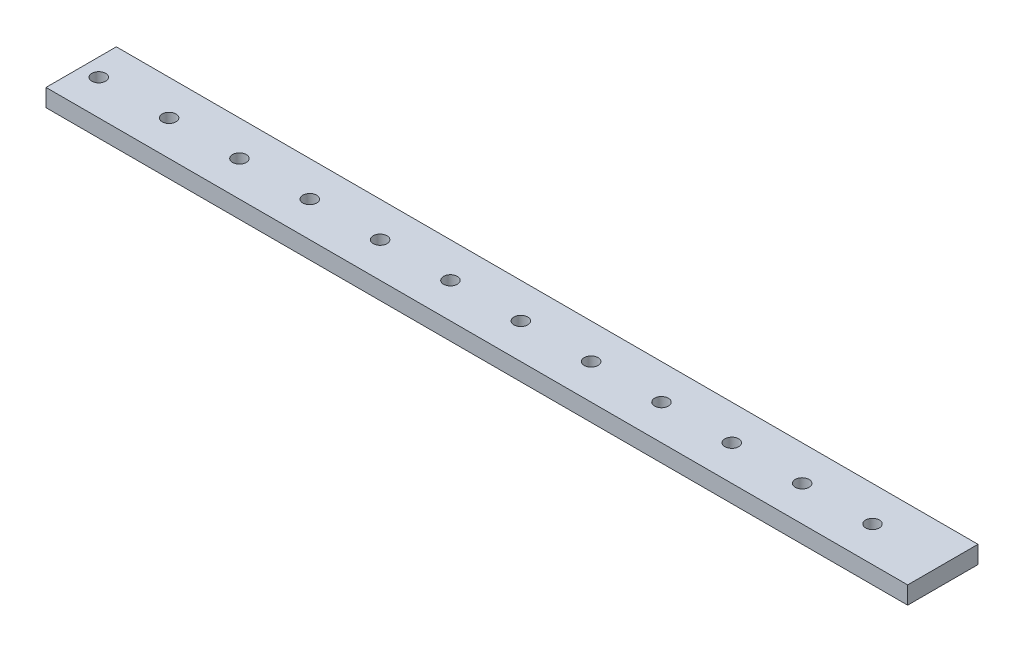
ISO-10303-21;
HEADER;
FILE_DESCRIPTION(('STEP AP214'),'2;1');
FILE_NAME('part.step','',(''),(''),'','','');
FILE_SCHEMA(('AUTOMOTIVE_DESIGN { 1 0 10303 214 1 1 1 1 }'));
ENDSEC;
DATA;
#1=APPLICATION_CONTEXT('core data for automotive mechanical design processes');
#2=APPLICATION_PROTOCOL_DEFINITION('international standard','automotive_design',2000,#1);
#3=PRODUCT_CONTEXT('',#1,'mechanical');
#4=PRODUCT('Part','Part','',(#3));
#5=PRODUCT_RELATED_PRODUCT_CATEGORY('part','',(#4));
#6=PRODUCT_DEFINITION_FORMATION('','',#4);
#7=PRODUCT_DEFINITION_CONTEXT('part definition',#1,'design');
#8=PRODUCT_DEFINITION('design','',#6,#7);
#9=PRODUCT_DEFINITION_SHAPE('','',#8);
#10=(LENGTH_UNIT() NAMED_UNIT(*) SI_UNIT(.MILLI.,.METRE.));
#11=(NAMED_UNIT(*) PLANE_ANGLE_UNIT() SI_UNIT($,.RADIAN.));
#12=(NAMED_UNIT(*) SI_UNIT($,.STERADIAN.) SOLID_ANGLE_UNIT());
#13=UNCERTAINTY_MEASURE_WITH_UNIT(LENGTH_MEASURE(1.E-05),#10,'distance_accuracy_value','');
#14=(GEOMETRIC_REPRESENTATION_CONTEXT(3) GLOBAL_UNCERTAINTY_ASSIGNED_CONTEXT((#13)) GLOBAL_UNIT_ASSIGNED_CONTEXT((#10,
#11,#12)) REPRESENTATION_CONTEXT('',''));
#15=CARTESIAN_POINT('',(0.,0.,0.));
#16=DIRECTION('',(0.,0.,1.));
#17=DIRECTION('',(1.,0.,0.));
#18=AXIS2_PLACEMENT_3D('',#15,#16,#17);
#19=CARTESIAN_POINT('',(0.,6.35,0.));
#20=DIRECTION('',(0.,0.,-1.));
#21=DIRECTION('',(-1.,0.,0.));
#22=AXIS2_PLACEMENT_3D('',#19,#20,#21);
#23=PLANE('',#22);
#24=DIRECTION('',(0.,1.,0.));
#25=VECTOR('',#24,1.);
#26=CARTESIAN_POINT('',(95.25,6.35,0.));
#27=LINE('',#26,#25);
#28=CARTESIAN_POINT('',(95.25,0.,0.));
#29=VERTEX_POINT('',#28);
#30=CARTESIAN_POINT('',(95.25,6.35,0.));
#31=VERTEX_POINT('',#30);
#32=EDGE_CURVE('E205',#29,#31,#27,.T.);
#33=ORIENTED_EDGE('',*,*,#32,.F.);
#34=DIRECTION('',(1.,0.,0.));
#35=VECTOR('',#34,1.);
#36=CARTESIAN_POINT('',(0.,0.,0.));
#37=LINE('',#36,#35);
#38=CARTESIAN_POINT('',(406.4,0.,0.));
#39=VERTEX_POINT('',#38);
#40=EDGE_CURVE('E85',#29,#39,#37,.T.);
#41=ORIENTED_EDGE('',*,*,#40,.T.);
#42=DIRECTION('',(0.,-1.,0.));
#43=VECTOR('',#42,1.);
#44=CARTESIAN_POINT('',(406.4,6.35,0.));
#45=LINE('',#44,#43);
#46=CARTESIAN_POINT('',(406.4,6.35,0.));
#47=VERTEX_POINT('',#46);
#48=EDGE_CURVE('E11',#47,#39,#45,.T.);
#49=ORIENTED_EDGE('',*,*,#48,.F.);
#50=DIRECTION('',(1.,0.,0.));
#51=VECTOR('',#50,1.);
#52=CARTESIAN_POINT('',(0.,6.35,0.));
#53=LINE('',#52,#51);
#54=EDGE_CURVE('E95',#31,#47,#53,.T.);
#55=ORIENTED_EDGE('',*,*,#54,.F.);
#56=EDGE_LOOP('',(#33,#41,#49,#55));
#57=FACE_BOUND('',#56,.T.);
#58=ADVANCED_FACE('F39',(#57),#23,.F.);
#59=CARTESIAN_POINT('',(0.,6.35,-25.4));
#60=DIRECTION('',(0.,0.,1.));
#61=DIRECTION('',(1.,0.,0.));
#62=AXIS2_PLACEMENT_3D('',#59,#60,#61);
#63=PLANE('',#62);
#64=DIRECTION('',(0.,-1.,0.));
#65=VECTOR('',#64,1.);
#66=CARTESIAN_POINT('',(95.25,6.35,-25.4));
#67=LINE('',#66,#65);
#68=CARTESIAN_POINT('',(95.25,6.35,-25.4));
#69=VERTEX_POINT('',#68);
#70=CARTESIAN_POINT('',(95.25,0.,-25.4));
#71=VERTEX_POINT('',#70);
#72=EDGE_CURVE('E54',#69,#71,#67,.T.);
#73=ORIENTED_EDGE('',*,*,#72,.F.);
#74=DIRECTION('',(-1.,0.,0.));
#75=VECTOR('',#74,1.);
#76=CARTESIAN_POINT('',(0.,6.35,-25.4));
#77=LINE('',#76,#75);
#78=CARTESIAN_POINT('',(406.4,6.35,-25.4));
#79=VERTEX_POINT('',#78);
#80=EDGE_CURVE('E90',#79,#69,#77,.T.);
#81=ORIENTED_EDGE('',*,*,#80,.F.);
#82=DIRECTION('',(0.,-1.,0.));
#83=VECTOR('',#82,1.);
#84=CARTESIAN_POINT('',(406.4,6.35,-25.4));
#85=LINE('',#84,#83);
#86=CARTESIAN_POINT('',(406.4,0.,-25.4));
#87=VERTEX_POINT('',#86);
#88=EDGE_CURVE('E47',#79,#87,#85,.T.);
#89=ORIENTED_EDGE('',*,*,#88,.T.);
#90=DIRECTION('',(-1.,0.,0.));
#91=VECTOR('',#90,1.);
#92=CARTESIAN_POINT('',(0.,0.,-25.4));
#93=LINE('',#92,#91);
#94=EDGE_CURVE('E84',#87,#71,#93,.T.);
#95=ORIENTED_EDGE('',*,*,#94,.T.);
#96=EDGE_LOOP('',(#73,#81,#89,#95));
#97=FACE_BOUND('',#96,.T.);
#98=ADVANCED_FACE('F89',(#97),#63,.F.);
#99=CARTESIAN_POINT('',(0.,6.35,0.));
#100=DIRECTION('',(0.,-1.,0.));
#101=DIRECTION('',(0.,0.,-1.));
#102=AXIS2_PLACEMENT_3D('',#99,#100,#101);
#103=PLANE('',#102);
#104=CARTESIAN_POINT('',(101.6,6.35,-12.7));
#105=DIRECTION('',(0.,1.,0.));
#106=DIRECTION('',(0.,0.,1.));
#107=AXIS2_PLACEMENT_3D('',#104,#105,#106);
#108=CIRCLE('',#107,2.4892);
#109=CARTESIAN_POINT('',(101.6,6.35,-10.2108));
#110=VERTEX_POINT('',#109);
#111=EDGE_CURVE('E107',#110,#110,#108,.T.);
#112=ORIENTED_EDGE('',*,*,#111,.F.);
#113=EDGE_LOOP('',(#112));
#114=FACE_BOUND('',#113,.T.);
#115=CARTESIAN_POINT('',(127.,6.35,-12.7));
#116=DIRECTION('',(0.,1.,0.));
#117=DIRECTION('',(0.,0.,1.));
#118=AXIS2_PLACEMENT_3D('',#115,#116,#117);
#119=CIRCLE('',#118,2.4892);
#120=CARTESIAN_POINT('',(127.,6.35,-10.2108));
#121=VERTEX_POINT('',#120);
#122=EDGE_CURVE('E116',#121,#121,#119,.T.);
#123=ORIENTED_EDGE('',*,*,#122,.F.);
#124=EDGE_LOOP('',(#123));
#125=FACE_BOUND('',#124,.T.);
#126=CARTESIAN_POINT('',(152.4,6.35,-12.7));
#127=DIRECTION('',(0.,1.,0.));
#128=DIRECTION('',(0.,0.,1.));
#129=AXIS2_PLACEMENT_3D('',#126,#127,#128);
#130=CIRCLE('',#129,2.4892);
#131=CARTESIAN_POINT('',(152.4,6.35,-10.2108));
#132=VERTEX_POINT('',#131);
#133=EDGE_CURVE('E124',#132,#132,#130,.T.);
#134=ORIENTED_EDGE('',*,*,#133,.F.);
#135=EDGE_LOOP('',(#134));
#136=FACE_BOUND('',#135,.T.);
#137=CARTESIAN_POINT('',(177.8,6.35,-12.7));
#138=DIRECTION('',(0.,1.,0.));
#139=DIRECTION('',(0.,0.,1.));
#140=AXIS2_PLACEMENT_3D('',#137,#138,#139);
#141=CIRCLE('',#140,2.4892);
#142=CARTESIAN_POINT('',(177.8,6.35,-10.2108));
#143=VERTEX_POINT('',#142);
#144=EDGE_CURVE('E132',#143,#143,#141,.T.);
#145=ORIENTED_EDGE('',*,*,#144,.F.);
#146=EDGE_LOOP('',(#145));
#147=FACE_BOUND('',#146,.T.);
#148=CARTESIAN_POINT('',(203.2,6.35,-12.7));
#149=DIRECTION('',(0.,1.,0.));
#150=DIRECTION('',(0.,0.,1.));
#151=AXIS2_PLACEMENT_3D('',#148,#149,#150);
#152=CIRCLE('',#151,2.4892);
#153=CARTESIAN_POINT('',(203.2,6.35,-10.2108));
#154=VERTEX_POINT('',#153);
#155=EDGE_CURVE('E140',#154,#154,#152,.T.);
#156=ORIENTED_EDGE('',*,*,#155,.F.);
#157=EDGE_LOOP('',(#156));
#158=FACE_BOUND('',#157,.T.);
#159=CARTESIAN_POINT('',(228.6,6.35,-12.7));
#160=DIRECTION('',(0.,1.,0.));
#161=DIRECTION('',(0.,0.,1.));
#162=AXIS2_PLACEMENT_3D('',#159,#160,#161);
#163=CIRCLE('',#162,2.4892);
#164=CARTESIAN_POINT('',(228.6,6.35,-10.2108));
#165=VERTEX_POINT('',#164);
#166=EDGE_CURVE('E148',#165,#165,#163,.T.);
#167=ORIENTED_EDGE('',*,*,#166,.F.);
#168=EDGE_LOOP('',(#167));
#169=FACE_BOUND('',#168,.T.);
#170=CARTESIAN_POINT('',(254.,6.35,-12.7));
#171=DIRECTION('',(0.,1.,0.));
#172=DIRECTION('',(0.,0.,1.));
#173=AXIS2_PLACEMENT_3D('',#170,#171,#172);
#174=CIRCLE('',#173,2.48920000000001);
#175=CARTESIAN_POINT('',(254.,6.35,-10.2108));
#176=VERTEX_POINT('',#175);
#177=EDGE_CURVE('E156',#176,#176,#174,.T.);
#178=ORIENTED_EDGE('',*,*,#177,.F.);
#179=EDGE_LOOP('',(#178));
#180=FACE_BOUND('',#179,.T.);
#181=CARTESIAN_POINT('',(279.4,6.35,-12.7));
#182=DIRECTION('',(0.,1.,0.));
#183=DIRECTION('',(0.,0.,1.));
#184=AXIS2_PLACEMENT_3D('',#181,#182,#183);
#185=CIRCLE('',#184,2.48920000000001);
#186=CARTESIAN_POINT('',(279.4,6.35,-10.2108));
#187=VERTEX_POINT('',#186);
#188=EDGE_CURVE('E164',#187,#187,#185,.T.);
#189=ORIENTED_EDGE('',*,*,#188,.F.);
#190=EDGE_LOOP('',(#189));
#191=FACE_BOUND('',#190,.T.);
#192=CARTESIAN_POINT('',(304.8,6.35,-12.7));
#193=DIRECTION('',(0.,1.,0.));
#194=DIRECTION('',(0.,0.,1.));
#195=AXIS2_PLACEMENT_3D('',#192,#193,#194);
#196=CIRCLE('',#195,2.48920000000001);
#197=CARTESIAN_POINT('',(304.8,6.35,-10.2108));
#198=VERTEX_POINT('',#197);
#199=EDGE_CURVE('E172',#198,#198,#196,.T.);
#200=ORIENTED_EDGE('',*,*,#199,.F.);
#201=EDGE_LOOP('',(#200));
#202=FACE_BOUND('',#201,.T.);
#203=CARTESIAN_POINT('',(330.2,6.35,-12.7));
#204=DIRECTION('',(0.,1.,0.));
#205=DIRECTION('',(0.,0.,1.));
#206=AXIS2_PLACEMENT_3D('',#203,#204,#205);
#207=CIRCLE('',#206,2.48920000000001);
#208=CARTESIAN_POINT('',(330.2,6.35,-10.2108));
#209=VERTEX_POINT('',#208);
#210=EDGE_CURVE('E180',#209,#209,#207,.T.);
#211=ORIENTED_EDGE('',*,*,#210,.F.);
#212=EDGE_LOOP('',(#211));
#213=FACE_BOUND('',#212,.T.);
#214=CARTESIAN_POINT('',(355.6,6.35,-12.7));
#215=DIRECTION('',(0.,1.,0.));
#216=DIRECTION('',(0.,0.,1.));
#217=AXIS2_PLACEMENT_3D('',#214,#215,#216);
#218=CIRCLE('',#217,2.48920000000001);
#219=CARTESIAN_POINT('',(355.6,6.35,-10.2108));
#220=VERTEX_POINT('',#219);
#221=EDGE_CURVE('E188',#220,#220,#218,.T.);
#222=ORIENTED_EDGE('',*,*,#221,.F.);
#223=EDGE_LOOP('',(#222));
#224=FACE_BOUND('',#223,.T.);
#225=CARTESIAN_POINT('',(381.,6.35,-12.7));
#226=DIRECTION('',(0.,1.,0.));
#227=DIRECTION('',(0.,0.,1.));
#228=AXIS2_PLACEMENT_3D('',#225,#226,#227);
#229=CIRCLE('',#228,2.48920000000001);
#230=CARTESIAN_POINT('',(381.,6.35,-10.2108));
#231=VERTEX_POINT('',#230);
#232=EDGE_CURVE('E196',#231,#231,#229,.T.);
#233=ORIENTED_EDGE('',*,*,#232,.F.);
#234=EDGE_LOOP('',(#233));
#235=FACE_BOUND('',#234,.T.);
#236=DIRECTION('',(0.,0.,-1.));
#237=VECTOR('',#236,1.);
#238=CARTESIAN_POINT('',(95.25,6.35,-25.4));
#239=LINE('',#238,#237);
#240=EDGE_CURVE('E112',#31,#69,#239,.T.);
#241=ORIENTED_EDGE('',*,*,#240,.F.);
#242=ORIENTED_EDGE('',*,*,#54,.T.);
#243=DIRECTION('',(0.,0.,-1.));
#244=VECTOR('',#243,1.);
#245=CARTESIAN_POINT('',(406.4,6.35,0.));
#246=LINE('',#245,#244);
#247=EDGE_CURVE('E63',#47,#79,#246,.T.);
#248=ORIENTED_EDGE('',*,*,#247,.T.);
#249=ORIENTED_EDGE('',*,*,#80,.T.);
#250=EDGE_LOOP('',(#241,#242,#248,#249));
#251=FACE_BOUND('',#250,.T.);
#252=ADVANCED_FACE('F221',(#114,#125,#136,#147,#158,#169,#180,#191,#202,#213,#224,#235,#251),
#103,.F.);
#253=CARTESIAN_POINT('',(0.,0.,0.));
#254=DIRECTION('',(0.,-1.,0.));
#255=DIRECTION('',(0.,0.,-1.));
#256=AXIS2_PLACEMENT_3D('',#253,#254,#255);
#257=PLANE('',#256);
#258=CARTESIAN_POINT('',(101.6,0.,-12.7));
#259=DIRECTION('',(0.,1.,0.));
#260=DIRECTION('',(0.,0.,1.));
#261=AXIS2_PLACEMENT_3D('',#258,#259,#260);
#262=CIRCLE('',#261,2.4892);
#263=CARTESIAN_POINT('',(101.6,0.,-10.2108));
#264=VERTEX_POINT('',#263);
#265=EDGE_CURVE('E111',#264,#264,#262,.T.);
#266=ORIENTED_EDGE('',*,*,#265,.T.);
#267=EDGE_LOOP('',(#266));
#268=FACE_BOUND('',#267,.T.);
#269=CARTESIAN_POINT('',(127.,0.,-12.7));
#270=DIRECTION('',(0.,1.,0.));
#271=DIRECTION('',(0.,0.,1.));
#272=AXIS2_PLACEMENT_3D('',#269,#270,#271);
#273=CIRCLE('',#272,2.4892);
#274=CARTESIAN_POINT('',(127.,0.,-10.2108));
#275=VERTEX_POINT('',#274);
#276=EDGE_CURVE('E120',#275,#275,#273,.T.);
#277=ORIENTED_EDGE('',*,*,#276,.T.);
#278=EDGE_LOOP('',(#277));
#279=FACE_BOUND('',#278,.T.);
#280=CARTESIAN_POINT('',(152.4,0.,-12.7));
#281=DIRECTION('',(0.,1.,0.));
#282=DIRECTION('',(0.,0.,1.));
#283=AXIS2_PLACEMENT_3D('',#280,#281,#282);
#284=CIRCLE('',#283,2.4892);
#285=CARTESIAN_POINT('',(152.4,0.,-10.2108));
#286=VERTEX_POINT('',#285);
#287=EDGE_CURVE('E128',#286,#286,#284,.T.);
#288=ORIENTED_EDGE('',*,*,#287,.T.);
#289=EDGE_LOOP('',(#288));
#290=FACE_BOUND('',#289,.T.);
#291=CARTESIAN_POINT('',(177.8,0.,-12.7));
#292=DIRECTION('',(0.,1.,0.));
#293=DIRECTION('',(0.,0.,1.));
#294=AXIS2_PLACEMENT_3D('',#291,#292,#293);
#295=CIRCLE('',#294,2.4892);
#296=CARTESIAN_POINT('',(177.8,0.,-10.2108));
#297=VERTEX_POINT('',#296);
#298=EDGE_CURVE('E136',#297,#297,#295,.T.);
#299=ORIENTED_EDGE('',*,*,#298,.T.);
#300=EDGE_LOOP('',(#299));
#301=FACE_BOUND('',#300,.T.);
#302=CARTESIAN_POINT('',(203.2,0.,-12.7));
#303=DIRECTION('',(0.,1.,0.));
#304=DIRECTION('',(0.,0.,1.));
#305=AXIS2_PLACEMENT_3D('',#302,#303,#304);
#306=CIRCLE('',#305,2.4892);
#307=CARTESIAN_POINT('',(203.2,0.,-10.2108));
#308=VERTEX_POINT('',#307);
#309=EDGE_CURVE('E144',#308,#308,#306,.T.);
#310=ORIENTED_EDGE('',*,*,#309,.T.);
#311=EDGE_LOOP('',(#310));
#312=FACE_BOUND('',#311,.T.);
#313=CARTESIAN_POINT('',(228.6,0.,-12.7));
#314=DIRECTION('',(0.,1.,0.));
#315=DIRECTION('',(0.,0.,1.));
#316=AXIS2_PLACEMENT_3D('',#313,#314,#315);
#317=CIRCLE('',#316,2.4892);
#318=CARTESIAN_POINT('',(228.6,0.,-10.2108));
#319=VERTEX_POINT('',#318);
#320=EDGE_CURVE('E152',#319,#319,#317,.T.);
#321=ORIENTED_EDGE('',*,*,#320,.T.);
#322=EDGE_LOOP('',(#321));
#323=FACE_BOUND('',#322,.T.);
#324=CARTESIAN_POINT('',(254.,0.,-12.7));
#325=DIRECTION('',(0.,1.,0.));
#326=DIRECTION('',(0.,0.,1.));
#327=AXIS2_PLACEMENT_3D('',#324,#325,#326);
#328=CIRCLE('',#327,2.48920000000001);
#329=CARTESIAN_POINT('',(254.,0.,-10.2108));
#330=VERTEX_POINT('',#329);
#331=EDGE_CURVE('E160',#330,#330,#328,.T.);
#332=ORIENTED_EDGE('',*,*,#331,.T.);
#333=EDGE_LOOP('',(#332));
#334=FACE_BOUND('',#333,.T.);
#335=CARTESIAN_POINT('',(279.4,0.,-12.7));
#336=DIRECTION('',(0.,1.,0.));
#337=DIRECTION('',(0.,0.,1.));
#338=AXIS2_PLACEMENT_3D('',#335,#336,#337);
#339=CIRCLE('',#338,2.48920000000001);
#340=CARTESIAN_POINT('',(279.4,0.,-10.2108));
#341=VERTEX_POINT('',#340);
#342=EDGE_CURVE('E168',#341,#341,#339,.T.);
#343=ORIENTED_EDGE('',*,*,#342,.T.);
#344=EDGE_LOOP('',(#343));
#345=FACE_BOUND('',#344,.T.);
#346=CARTESIAN_POINT('',(304.8,0.,-12.7));
#347=DIRECTION('',(0.,1.,0.));
#348=DIRECTION('',(0.,0.,1.));
#349=AXIS2_PLACEMENT_3D('',#346,#347,#348);
#350=CIRCLE('',#349,2.48920000000001);
#351=CARTESIAN_POINT('',(304.8,0.,-10.2108));
#352=VERTEX_POINT('',#351);
#353=EDGE_CURVE('E176',#352,#352,#350,.T.);
#354=ORIENTED_EDGE('',*,*,#353,.T.);
#355=EDGE_LOOP('',(#354));
#356=FACE_BOUND('',#355,.T.);
#357=CARTESIAN_POINT('',(330.2,0.,-12.7));
#358=DIRECTION('',(0.,1.,0.));
#359=DIRECTION('',(0.,0.,1.));
#360=AXIS2_PLACEMENT_3D('',#357,#358,#359);
#361=CIRCLE('',#360,2.48920000000001);
#362=CARTESIAN_POINT('',(330.2,0.,-10.2108));
#363=VERTEX_POINT('',#362);
#364=EDGE_CURVE('E184',#363,#363,#361,.T.);
#365=ORIENTED_EDGE('',*,*,#364,.T.);
#366=EDGE_LOOP('',(#365));
#367=FACE_BOUND('',#366,.T.);
#368=CARTESIAN_POINT('',(355.6,0.,-12.7));
#369=DIRECTION('',(0.,1.,0.));
#370=DIRECTION('',(0.,0.,1.));
#371=AXIS2_PLACEMENT_3D('',#368,#369,#370);
#372=CIRCLE('',#371,2.48920000000001);
#373=CARTESIAN_POINT('',(355.6,0.,-10.2108));
#374=VERTEX_POINT('',#373);
#375=EDGE_CURVE('E192',#374,#374,#372,.T.);
#376=ORIENTED_EDGE('',*,*,#375,.T.);
#377=EDGE_LOOP('',(#376));
#378=FACE_BOUND('',#377,.T.);
#379=CARTESIAN_POINT('',(381.,0.,-12.7));
#380=DIRECTION('',(0.,1.,0.));
#381=DIRECTION('',(0.,0.,1.));
#382=AXIS2_PLACEMENT_3D('',#379,#380,#381);
#383=CIRCLE('',#382,2.48920000000001);
#384=CARTESIAN_POINT('',(381.,0.,-10.2108));
#385=VERTEX_POINT('',#384);
#386=EDGE_CURVE('E102',#385,#385,#383,.T.);
#387=ORIENTED_EDGE('',*,*,#386,.T.);
#388=EDGE_LOOP('',(#387));
#389=FACE_BOUND('',#388,.T.);
#390=ORIENTED_EDGE('',*,*,#40,.F.);
#391=DIRECTION('',(0.,0.,1.));
#392=VECTOR('',#391,1.);
#393=CARTESIAN_POINT('',(95.25,0.,-25.4));
#394=LINE('',#393,#392);
#395=EDGE_CURVE('E93',#71,#29,#394,.T.);
#396=ORIENTED_EDGE('',*,*,#395,.F.);
#397=ORIENTED_EDGE('',*,*,#94,.F.);
#398=DIRECTION('',(0.,0.,-1.));
#399=VECTOR('',#398,1.);
#400=CARTESIAN_POINT('',(406.4,0.,0.));
#401=LINE('',#400,#399);
#402=EDGE_CURVE('E75',#39,#87,#401,.T.);
#403=ORIENTED_EDGE('',*,*,#402,.F.);
#404=EDGE_LOOP('',(#390,#396,#397,#403));
#405=FACE_BOUND('',#404,.T.);
#406=ADVANCED_FACE('F92',(#268,#279,#290,#301,#312,#323,#334,#345,#356,#367,#378,#389,#405),
#257,.T.);
#407=CARTESIAN_POINT('',(406.4,6.35,0.));
#408=DIRECTION('',(-1.,0.,0.));
#409=DIRECTION('',(0.,0.,1.));
#410=AXIS2_PLACEMENT_3D('',#407,#408,#409);
#411=PLANE('',#410);
#412=ORIENTED_EDGE('',*,*,#402,.T.);
#413=ORIENTED_EDGE('',*,*,#88,.F.);
#414=ORIENTED_EDGE('',*,*,#247,.F.);
#415=ORIENTED_EDGE('',*,*,#48,.T.);
#416=EDGE_LOOP('',(#412,#413,#414,#415));
#417=FACE_BOUND('',#416,.T.);
#418=ADVANCED_FACE('F77',(#417),#411,.F.);
#419=CARTESIAN_POINT('',(101.6,0.,-12.7));
#420=DIRECTION('',(0.,1.,0.));
#421=DIRECTION('',(0.,0.,1.));
#422=AXIS2_PLACEMENT_3D('',#419,#420,#421);
#423=CYLINDRICAL_SURFACE('',#422,2.4892);
#424=ORIENTED_EDGE('',*,*,#265,.F.);
#425=EDGE_LOOP('',(#424));
#426=FACE_BOUND('',#425,.T.);
#427=ORIENTED_EDGE('',*,*,#111,.T.);
#428=EDGE_LOOP('',(#427));
#429=FACE_BOUND('',#428,.T.);
#430=ADVANCED_FACE('F356',(#426,#429),#423,.F.);
#431=CARTESIAN_POINT('',(127.,0.,-12.7));
#432=DIRECTION('',(0.,1.,0.));
#433=DIRECTION('',(0.,0.,1.));
#434=AXIS2_PLACEMENT_3D('',#431,#432,#433);
#435=CYLINDRICAL_SURFACE('',#434,2.4892);
#436=ORIENTED_EDGE('',*,*,#276,.F.);
#437=EDGE_LOOP('',(#436));
#438=FACE_BOUND('',#437,.T.);
#439=ORIENTED_EDGE('',*,*,#122,.T.);
#440=EDGE_LOOP('',(#439));
#441=FACE_BOUND('',#440,.T.);
#442=ADVANCED_FACE('F347',(#438,#441),#435,.F.);
#443=CARTESIAN_POINT('',(152.4,0.,-12.7));
#444=DIRECTION('',(0.,1.,0.));
#445=DIRECTION('',(0.,0.,1.));
#446=AXIS2_PLACEMENT_3D('',#443,#444,#445);
#447=CYLINDRICAL_SURFACE('',#446,2.4892);
#448=ORIENTED_EDGE('',*,*,#287,.F.);
#449=EDGE_LOOP('',(#448));
#450=FACE_BOUND('',#449,.T.);
#451=ORIENTED_EDGE('',*,*,#133,.T.);
#452=EDGE_LOOP('',(#451));
#453=FACE_BOUND('',#452,.T.);
#454=ADVANCED_FACE('F338',(#450,#453),#447,.F.);
#455=CARTESIAN_POINT('',(177.8,0.,-12.7));
#456=DIRECTION('',(0.,1.,0.));
#457=DIRECTION('',(0.,0.,1.));
#458=AXIS2_PLACEMENT_3D('',#455,#456,#457);
#459=CYLINDRICAL_SURFACE('',#458,2.4892);
#460=ORIENTED_EDGE('',*,*,#298,.F.);
#461=EDGE_LOOP('',(#460));
#462=FACE_BOUND('',#461,.T.);
#463=ORIENTED_EDGE('',*,*,#144,.T.);
#464=EDGE_LOOP('',(#463));
#465=FACE_BOUND('',#464,.T.);
#466=ADVANCED_FACE('F329',(#462,#465),#459,.F.);
#467=CARTESIAN_POINT('',(203.2,0.,-12.7));
#468=DIRECTION('',(0.,1.,0.));
#469=DIRECTION('',(0.,0.,1.));
#470=AXIS2_PLACEMENT_3D('',#467,#468,#469);
#471=CYLINDRICAL_SURFACE('',#470,2.4892);
#472=ORIENTED_EDGE('',*,*,#309,.F.);
#473=EDGE_LOOP('',(#472));
#474=FACE_BOUND('',#473,.T.);
#475=ORIENTED_EDGE('',*,*,#155,.T.);
#476=EDGE_LOOP('',(#475));
#477=FACE_BOUND('',#476,.T.);
#478=ADVANCED_FACE('F320',(#474,#477),#471,.F.);
#479=CARTESIAN_POINT('',(228.6,0.,-12.7));
#480=DIRECTION('',(0.,1.,0.));
#481=DIRECTION('',(0.,0.,1.));
#482=AXIS2_PLACEMENT_3D('',#479,#480,#481);
#483=CYLINDRICAL_SURFACE('',#482,2.4892);
#484=ORIENTED_EDGE('',*,*,#320,.F.);
#485=EDGE_LOOP('',(#484));
#486=FACE_BOUND('',#485,.T.);
#487=ORIENTED_EDGE('',*,*,#166,.T.);
#488=EDGE_LOOP('',(#487));
#489=FACE_BOUND('',#488,.T.);
#490=ADVANCED_FACE('F311',(#486,#489),#483,.F.);
#491=CARTESIAN_POINT('',(254.,0.,-12.7));
#492=DIRECTION('',(0.,1.,0.));
#493=DIRECTION('',(0.,0.,1.));
#494=AXIS2_PLACEMENT_3D('',#491,#492,#493);
#495=CYLINDRICAL_SURFACE('',#494,2.48920000000001);
#496=ORIENTED_EDGE('',*,*,#331,.F.);
#497=EDGE_LOOP('',(#496));
#498=FACE_BOUND('',#497,.T.);
#499=ORIENTED_EDGE('',*,*,#177,.T.);
#500=EDGE_LOOP('',(#499));
#501=FACE_BOUND('',#500,.T.);
#502=ADVANCED_FACE('F302',(#498,#501),#495,.F.);
#503=CARTESIAN_POINT('',(279.4,0.,-12.7));
#504=DIRECTION('',(0.,1.,0.));
#505=DIRECTION('',(0.,0.,1.));
#506=AXIS2_PLACEMENT_3D('',#503,#504,#505);
#507=CYLINDRICAL_SURFACE('',#506,2.48920000000001);
#508=ORIENTED_EDGE('',*,*,#342,.F.);
#509=EDGE_LOOP('',(#508));
#510=FACE_BOUND('',#509,.T.);
#511=ORIENTED_EDGE('',*,*,#188,.T.);
#512=EDGE_LOOP('',(#511));
#513=FACE_BOUND('',#512,.T.);
#514=ADVANCED_FACE('F293',(#510,#513),#507,.F.);
#515=CARTESIAN_POINT('',(304.8,0.,-12.7));
#516=DIRECTION('',(0.,1.,0.));
#517=DIRECTION('',(0.,0.,1.));
#518=AXIS2_PLACEMENT_3D('',#515,#516,#517);
#519=CYLINDRICAL_SURFACE('',#518,2.48920000000001);
#520=ORIENTED_EDGE('',*,*,#353,.F.);
#521=EDGE_LOOP('',(#520));
#522=FACE_BOUND('',#521,.T.);
#523=ORIENTED_EDGE('',*,*,#199,.T.);
#524=EDGE_LOOP('',(#523));
#525=FACE_BOUND('',#524,.T.);
#526=ADVANCED_FACE('F284',(#522,#525),#519,.F.);
#527=CARTESIAN_POINT('',(330.2,0.,-12.7));
#528=DIRECTION('',(0.,1.,0.));
#529=DIRECTION('',(0.,0.,1.));
#530=AXIS2_PLACEMENT_3D('',#527,#528,#529);
#531=CYLINDRICAL_SURFACE('',#530,2.48920000000001);
#532=ORIENTED_EDGE('',*,*,#364,.F.);
#533=EDGE_LOOP('',(#532));
#534=FACE_BOUND('',#533,.T.);
#535=ORIENTED_EDGE('',*,*,#210,.T.);
#536=EDGE_LOOP('',(#535));
#537=FACE_BOUND('',#536,.T.);
#538=ADVANCED_FACE('F275',(#534,#537),#531,.F.);
#539=CARTESIAN_POINT('',(355.6,0.,-12.7));
#540=DIRECTION('',(0.,1.,0.));
#541=DIRECTION('',(0.,0.,1.));
#542=AXIS2_PLACEMENT_3D('',#539,#540,#541);
#543=CYLINDRICAL_SURFACE('',#542,2.48920000000001);
#544=ORIENTED_EDGE('',*,*,#375,.F.);
#545=EDGE_LOOP('',(#544));
#546=FACE_BOUND('',#545,.T.);
#547=ORIENTED_EDGE('',*,*,#221,.T.);
#548=EDGE_LOOP('',(#547));
#549=FACE_BOUND('',#548,.T.);
#550=ADVANCED_FACE('F268',(#546,#549),#543,.F.);
#551=CARTESIAN_POINT('',(381.,0.,-12.7));
#552=DIRECTION('',(0.,1.,0.));
#553=DIRECTION('',(0.,0.,1.));
#554=AXIS2_PLACEMENT_3D('',#551,#552,#553);
#555=CYLINDRICAL_SURFACE('',#554,2.48920000000001);
#556=ORIENTED_EDGE('',*,*,#386,.F.);
#557=EDGE_LOOP('',(#556));
#558=FACE_BOUND('',#557,.T.);
#559=ORIENTED_EDGE('',*,*,#232,.T.);
#560=EDGE_LOOP('',(#559));
#561=FACE_BOUND('',#560,.T.);
#562=ADVANCED_FACE('F244',(#558,#561),#555,.F.);
#563=CARTESIAN_POINT('',(95.25,0.,0.));
#564=DIRECTION('',(-1.,0.,0.));
#565=DIRECTION('',(0.,0.,1.));
#566=AXIS2_PLACEMENT_3D('',#563,#564,#565);
#567=PLANE('',#566);
#568=ORIENTED_EDGE('',*,*,#72,.T.);
#569=ORIENTED_EDGE('',*,*,#395,.T.);
#570=ORIENTED_EDGE('',*,*,#32,.T.);
#571=ORIENTED_EDGE('',*,*,#240,.T.);
#572=EDGE_LOOP('',(#568,#569,#570,#571));
#573=FACE_BOUND('',#572,.T.);
#574=ADVANCED_FACE('F214',(#573),#567,.T.);
#575=CLOSED_SHELL('',(#58,#98,#252,#406,#418,#430,#442,#454,#466,#478,#490,#502,#514,#526,#538,
#550,#562,#574));
#576=MANIFOLD_SOLID_BREP('B2',#575);
#577=ADVANCED_BREP_SHAPE_REPRESENTATION('',(#18,#576),#14);
#578=SHAPE_DEFINITION_REPRESENTATION(#9,#577);
ENDSEC;
END-ISO-10303-21;
